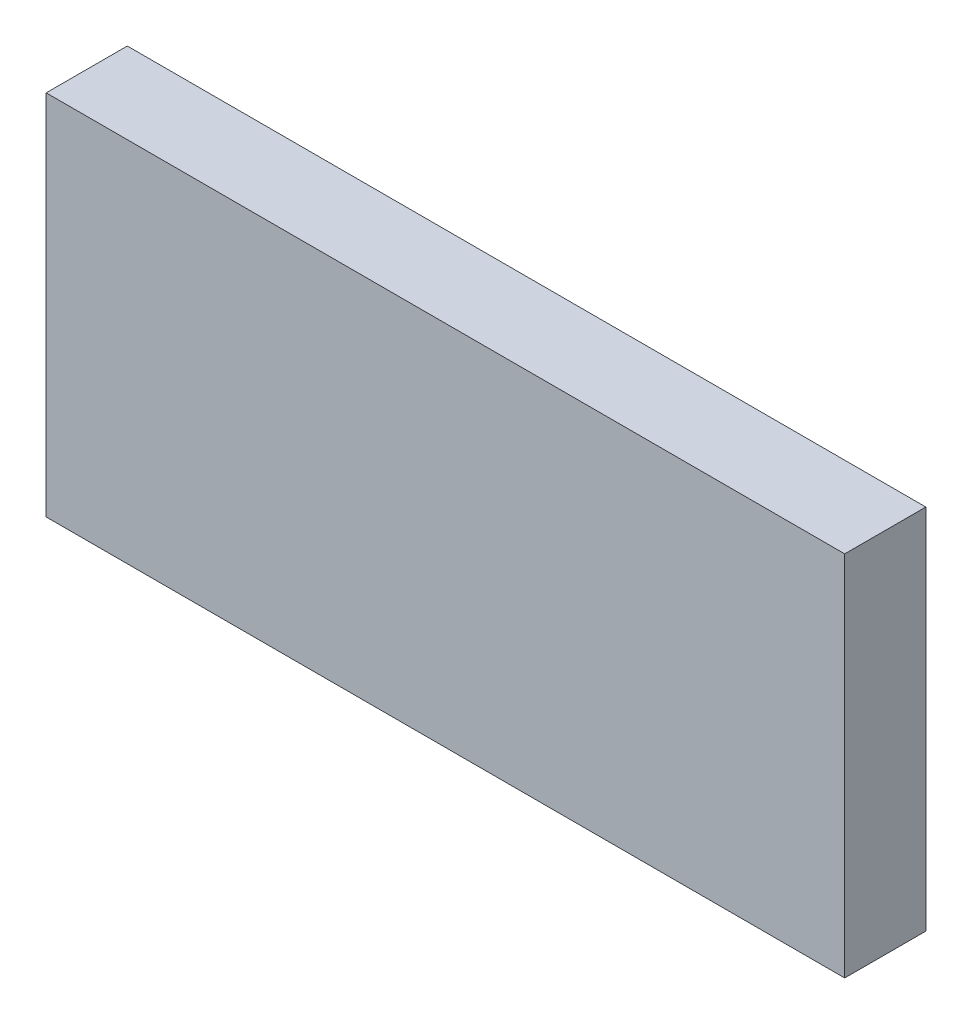
ISO-10303-21;
HEADER;
FILE_DESCRIPTION(('STEP AP214'),'2;1');
FILE_NAME('part.step','',(''),(''),'','','');
FILE_SCHEMA(('AUTOMOTIVE_DESIGN { 1 0 10303 214 1 1 1 1 }'));
ENDSEC;
DATA;
#1=APPLICATION_CONTEXT('core data for automotive mechanical design processes');
#2=APPLICATION_PROTOCOL_DEFINITION('international standard','automotive_design',2000,#1);
#3=PRODUCT_CONTEXT('',#1,'mechanical');
#4=PRODUCT('Part','Part','',(#3));
#5=PRODUCT_RELATED_PRODUCT_CATEGORY('part','',(#4));
#6=PRODUCT_DEFINITION_FORMATION('','',#4);
#7=PRODUCT_DEFINITION_CONTEXT('part definition',#1,'design');
#8=PRODUCT_DEFINITION('design','',#6,#7);
#9=PRODUCT_DEFINITION_SHAPE('','',#8);
#10=(LENGTH_UNIT() NAMED_UNIT(*) SI_UNIT(.MILLI.,.METRE.));
#11=(NAMED_UNIT(*) PLANE_ANGLE_UNIT() SI_UNIT($,.RADIAN.));
#12=(NAMED_UNIT(*) SI_UNIT($,.STERADIAN.) SOLID_ANGLE_UNIT());
#13=UNCERTAINTY_MEASURE_WITH_UNIT(LENGTH_MEASURE(1.E-05),#10,'distance_accuracy_value','');
#14=(GEOMETRIC_REPRESENTATION_CONTEXT(3) GLOBAL_UNCERTAINTY_ASSIGNED_CONTEXT((#13)) GLOBAL_UNIT_ASSIGNED_CONTEXT((#10,
#11,#12)) REPRESENTATION_CONTEXT('',''));
#15=CARTESIAN_POINT('',(0.,0.,0.));
#16=DIRECTION('',(0.,0.,1.));
#17=DIRECTION('',(1.,0.,0.));
#18=AXIS2_PLACEMENT_3D('',#15,#16,#17);
#19=CARTESIAN_POINT('',(-1.25000004,0.57500012,0.));
#20=DIRECTION('',(1.,0.,0.));
#21=DIRECTION('',(0.,-1.,0.));
#22=AXIS2_PLACEMENT_3D('',#19,#20,#21);
#23=PLANE('',#22);
#24=DIRECTION('',(0.,-1.,0.));
#25=VECTOR('',#24,1.);
#26=CARTESIAN_POINT('',(-1.25000004,0.57500012,0.));
#27=LINE('',#26,#25);
#28=CARTESIAN_POINT('',(-1.25000004,0.57500012,0.));
#29=VERTEX_POINT('',#28);
#30=CARTESIAN_POINT('',(-1.25000004,-0.57500012,0.));
#31=VERTEX_POINT('',#30);
#32=EDGE_CURVE('E11',#29,#31,#27,.T.);
#33=ORIENTED_EDGE('',*,*,#32,.T.);
#34=DIRECTION('',(0.,0.,1.));
#35=VECTOR('',#34,1.);
#36=CARTESIAN_POINT('',(-1.25000004,-0.57500012,0.));
#37=LINE('',#36,#35);
#38=CARTESIAN_POINT('',(-1.25000004,-0.57500012,0.254));
#39=VERTEX_POINT('',#38);
#40=EDGE_CURVE('E24',#31,#39,#37,.T.);
#41=ORIENTED_EDGE('',*,*,#40,.T.);
#42=DIRECTION('',(0.,-1.,0.));
#43=VECTOR('',#42,1.);
#44=CARTESIAN_POINT('',(-1.25000004,0.57500012,0.254));
#45=LINE('',#44,#43);
#46=CARTESIAN_POINT('',(-1.25000004,0.57500012,0.254));
#47=VERTEX_POINT('',#46);
#48=EDGE_CURVE('E87',#47,#39,#45,.T.);
#49=ORIENTED_EDGE('',*,*,#48,.F.);
#50=DIRECTION('',(0.,0.,1.));
#51=VECTOR('',#50,1.);
#52=CARTESIAN_POINT('',(-1.25000004,0.57500012,0.));
#53=LINE('',#52,#51);
#54=EDGE_CURVE('E36',#29,#47,#53,.T.);
#55=ORIENTED_EDGE('',*,*,#54,.F.);
#56=EDGE_LOOP('',(#33,#41,#49,#55));
#57=FACE_BOUND('',#56,.T.);
#58=ADVANCED_FACE('F17',(#57),#23,.F.);
#59=CARTESIAN_POINT('',(-1.25000004,-0.57500012,0.));
#60=DIRECTION('',(0.,1.,0.));
#61=DIRECTION('',(1.,0.,0.));
#62=AXIS2_PLACEMENT_3D('',#59,#60,#61);
#63=PLANE('',#62);
#64=DIRECTION('',(1.,0.,0.));
#65=VECTOR('',#64,1.);
#66=CARTESIAN_POINT('',(-1.25000004,-0.57500012,0.));
#67=LINE('',#66,#65);
#68=CARTESIAN_POINT('',(1.25000004,-0.57500012,0.));
#69=VERTEX_POINT('',#68);
#70=EDGE_CURVE('E84',#31,#69,#67,.T.);
#71=ORIENTED_EDGE('',*,*,#70,.T.);
#72=DIRECTION('',(0.,0.,1.));
#73=VECTOR('',#72,1.);
#74=CARTESIAN_POINT('',(1.25000004,-0.57500012,0.));
#75=LINE('',#74,#73);
#76=CARTESIAN_POINT('',(1.25000004,-0.57500012,0.254));
#77=VERTEX_POINT('',#76);
#78=EDGE_CURVE('E82',#69,#77,#75,.T.);
#79=ORIENTED_EDGE('',*,*,#78,.T.);
#80=DIRECTION('',(1.,0.,0.));
#81=VECTOR('',#80,1.);
#82=CARTESIAN_POINT('',(-1.25000004,-0.57500012,0.254));
#83=LINE('',#82,#81);
#84=EDGE_CURVE('E62',#39,#77,#83,.T.);
#85=ORIENTED_EDGE('',*,*,#84,.F.);
#86=ORIENTED_EDGE('',*,*,#40,.F.);
#87=EDGE_LOOP('',(#71,#79,#85,#86));
#88=FACE_BOUND('',#87,.T.);
#89=ADVANCED_FACE('F89',(#88),#63,.F.);
#90=CARTESIAN_POINT('',(1.25000004,-0.57500012,0.));
#91=DIRECTION('',(-1.,0.,0.));
#92=DIRECTION('',(0.,1.,0.));
#93=AXIS2_PLACEMENT_3D('',#90,#91,#92);
#94=PLANE('',#93);
#95=DIRECTION('',(0.,1.,0.));
#96=VECTOR('',#95,1.);
#97=CARTESIAN_POINT('',(1.25000004,-0.57500012,0.));
#98=LINE('',#97,#96);
#99=CARTESIAN_POINT('',(1.25000004,0.57500012,0.));
#100=VERTEX_POINT('',#99);
#101=EDGE_CURVE('E71',#69,#100,#98,.T.);
#102=ORIENTED_EDGE('',*,*,#101,.T.);
#103=DIRECTION('',(0.,0.,1.));
#104=VECTOR('',#103,1.);
#105=CARTESIAN_POINT('',(1.25000004,0.57500012,0.));
#106=LINE('',#105,#104);
#107=CARTESIAN_POINT('',(1.25000004,0.57500012,0.254));
#108=VERTEX_POINT('',#107);
#109=EDGE_CURVE('E65',#100,#108,#106,.T.);
#110=ORIENTED_EDGE('',*,*,#109,.T.);
#111=DIRECTION('',(0.,1.,0.));
#112=VECTOR('',#111,1.);
#113=CARTESIAN_POINT('',(1.25000004,-0.57500012,0.254));
#114=LINE('',#113,#112);
#115=EDGE_CURVE('E57',#77,#108,#114,.T.);
#116=ORIENTED_EDGE('',*,*,#115,.F.);
#117=ORIENTED_EDGE('',*,*,#78,.F.);
#118=EDGE_LOOP('',(#102,#110,#116,#117));
#119=FACE_BOUND('',#118,.T.);
#120=ADVANCED_FACE('F69',(#119),#94,.F.);
#121=CARTESIAN_POINT('',(1.25000004,0.57500012,0.));
#122=DIRECTION('',(0.,-1.,0.));
#123=DIRECTION('',(-1.,0.,0.));
#124=AXIS2_PLACEMENT_3D('',#121,#122,#123);
#125=PLANE('',#124);
#126=DIRECTION('',(-1.,0.,0.));
#127=VECTOR('',#126,1.);
#128=CARTESIAN_POINT('',(1.25000004,0.57500012,0.));
#129=LINE('',#128,#127);
#130=EDGE_CURVE('E66',#100,#29,#129,.T.);
#131=ORIENTED_EDGE('',*,*,#130,.T.);
#132=ORIENTED_EDGE('',*,*,#54,.T.);
#133=DIRECTION('',(-1.,0.,0.));
#134=VECTOR('',#133,1.);
#135=CARTESIAN_POINT('',(1.25000004,0.57500012,0.254));
#136=LINE('',#135,#134);
#137=EDGE_CURVE('E61',#108,#47,#136,.T.);
#138=ORIENTED_EDGE('',*,*,#137,.F.);
#139=ORIENTED_EDGE('',*,*,#109,.F.);
#140=EDGE_LOOP('',(#131,#132,#138,#139));
#141=FACE_BOUND('',#140,.T.);
#142=ADVANCED_FACE('F76',(#141),#125,.F.);
#143=CARTESIAN_POINT('',(-1.25000004,0.57500012,0.));
#144=DIRECTION('',(0.,0.,-1.));
#145=DIRECTION('',(-1.,0.,0.));
#146=AXIS2_PLACEMENT_3D('',#143,#144,#145);
#147=PLANE('',#146);
#148=ORIENTED_EDGE('',*,*,#130,.F.);
#149=ORIENTED_EDGE('',*,*,#101,.F.);
#150=ORIENTED_EDGE('',*,*,#70,.F.);
#151=ORIENTED_EDGE('',*,*,#32,.F.);
#152=EDGE_LOOP('',(#148,#149,#150,#151));
#153=FACE_BOUND('',#152,.T.);
#154=ADVANCED_FACE('F91',(#153),#147,.T.);
#155=CARTESIAN_POINT('',(-1.25000004,0.57500012,0.254));
#156=DIRECTION('',(0.,0.,-1.));
#157=DIRECTION('',(-1.,0.,0.));
#158=AXIS2_PLACEMENT_3D('',#155,#156,#157);
#159=PLANE('',#158);
#160=ORIENTED_EDGE('',*,*,#48,.T.);
#161=ORIENTED_EDGE('',*,*,#84,.T.);
#162=ORIENTED_EDGE('',*,*,#115,.T.);
#163=ORIENTED_EDGE('',*,*,#137,.T.);
#164=EDGE_LOOP('',(#160,#161,#162,#163));
#165=FACE_BOUND('',#164,.T.);
#166=ADVANCED_FACE('F59',(#165),#159,.F.);
#167=CLOSED_SHELL('',(#58,#89,#120,#142,#154,#166));
#168=MANIFOLD_SOLID_BREP('B1',#167);
#169=ADVANCED_BREP_SHAPE_REPRESENTATION('',(#18,#168),#14);
#170=SHAPE_DEFINITION_REPRESENTATION(#9,#169);
ENDSEC;
END-ISO-10303-21;
